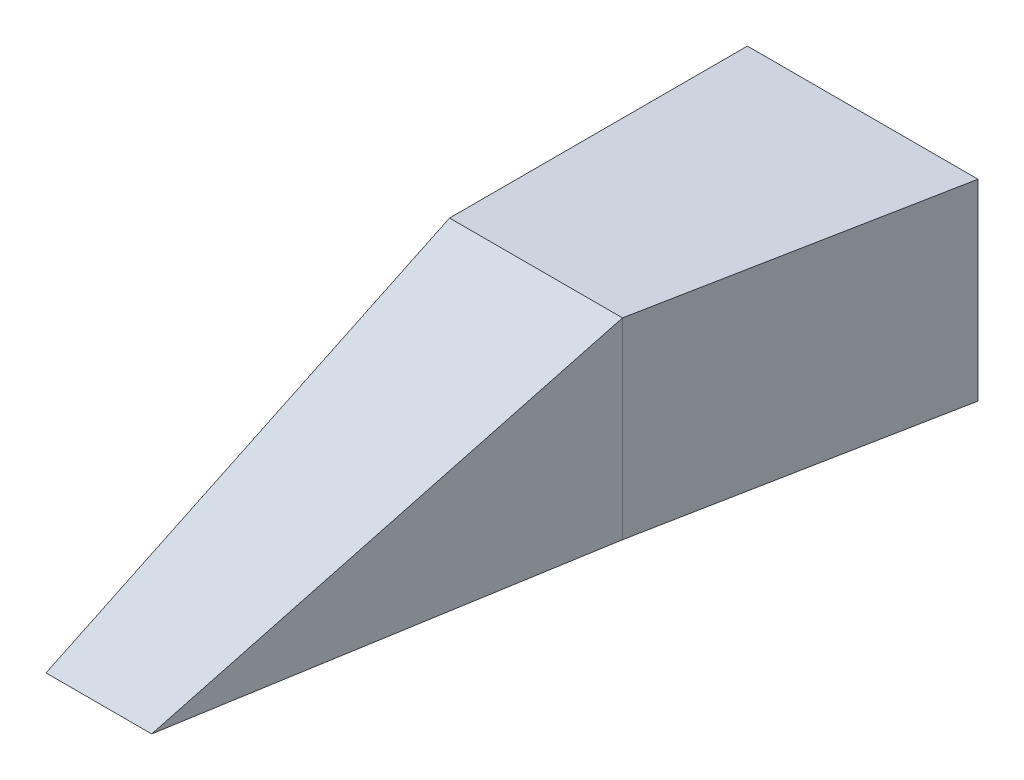
ISO-10303-21;
HEADER;
FILE_DESCRIPTION(('STEP AP214'),'2;1');
FILE_NAME('part.step','',(''),(''),'','','');
FILE_SCHEMA(('AUTOMOTIVE_DESIGN { 1 0 10303 214 1 1 1 1 }'));
ENDSEC;
DATA;
#1=APPLICATION_CONTEXT('core data for automotive mechanical design processes');
#2=APPLICATION_PROTOCOL_DEFINITION('international standard','automotive_design',2000,#1);
#3=PRODUCT_CONTEXT('',#1,'mechanical');
#4=PRODUCT('Part','Part','',(#3));
#5=PRODUCT_RELATED_PRODUCT_CATEGORY('part','',(#4));
#6=PRODUCT_DEFINITION_FORMATION('','',#4);
#7=PRODUCT_DEFINITION_CONTEXT('part definition',#1,'design');
#8=PRODUCT_DEFINITION('design','',#6,#7);
#9=PRODUCT_DEFINITION_SHAPE('','',#8);
#10=(LENGTH_UNIT() NAMED_UNIT(*) SI_UNIT(.MILLI.,.METRE.));
#11=(NAMED_UNIT(*) PLANE_ANGLE_UNIT() SI_UNIT($,.RADIAN.));
#12=(NAMED_UNIT(*) SI_UNIT($,.STERADIAN.) SOLID_ANGLE_UNIT());
#13=UNCERTAINTY_MEASURE_WITH_UNIT(LENGTH_MEASURE(1.E-05),#10,'distance_accuracy_value','');
#14=(GEOMETRIC_REPRESENTATION_CONTEXT(3) GLOBAL_UNCERTAINTY_ASSIGNED_CONTEXT((#13)) GLOBAL_UNIT_ASSIGNED_CONTEXT((#10,
#11,#12)) REPRESENTATION_CONTEXT('',''));
#15=CARTESIAN_POINT('',(0.,0.,0.));
#16=DIRECTION('',(0.,0.,1.));
#17=DIRECTION('',(1.,0.,0.));
#18=AXIS2_PLACEMENT_3D('',#15,#16,#17);
#19=CARTESIAN_POINT('',(0.,508.,-1066.8));
#20=DIRECTION('',(1.,0.,0.));
#21=DIRECTION('',(0.,0.,-1.));
#22=AXIS2_PLACEMENT_3D('',#19,#20,#21);
#23=PLANE('',#22);
#24=DIRECTION('',(0.,0.,1.));
#25=VECTOR('',#24,1.);
#26=CARTESIAN_POINT('',(0.,0.,-1066.8));
#27=LINE('',#26,#25);
#28=CARTESIAN_POINT('',(0.,0.,-1854.2));
#29=VERTEX_POINT('',#28);
#30=CARTESIAN_POINT('',(0.,0.,0.));
#31=VERTEX_POINT('',#30);
#32=EDGE_CURVE('E122',#29,#31,#27,.T.);
#33=ORIENTED_EDGE('',*,*,#32,.T.);
#34=DIRECTION('',(0.,-0.429933580392348,0.90286051882393));
#35=VECTOR('',#34,1.);
#36=CARTESIAN_POINT('',(0.,0.,0.));
#37=LINE('',#36,#35);
#38=CARTESIAN_POINT('',(0.,508.,-1066.8));
#39=VERTEX_POINT('',#38);
#40=EDGE_CURVE('E54',#39,#31,#37,.T.);
#41=ORIENTED_EDGE('',*,*,#40,.F.);
#42=DIRECTION('',(0.,0.,-1.));
#43=VECTOR('',#42,1.);
#44=CARTESIAN_POINT('',(0.,508.,-1066.8));
#45=LINE('',#44,#43);
#46=CARTESIAN_POINT('',(0.,508.,-1854.2));
#47=VERTEX_POINT('',#46);
#48=EDGE_CURVE('E100',#39,#47,#45,.T.);
#49=ORIENTED_EDGE('',*,*,#48,.T.);
#50=DIRECTION('',(0.,-1.,0.));
#51=VECTOR('',#50,1.);
#52=CARTESIAN_POINT('',(0.,508.,-1854.2));
#53=LINE('',#52,#51);
#54=EDGE_CURVE('E83',#47,#29,#53,.T.);
#55=ORIENTED_EDGE('',*,*,#54,.T.);
#56=EDGE_LOOP('',(#33,#41,#49,#55));
#57=FACE_BOUND('',#56,.T.);
#58=ADVANCED_FACE('F39',(#57),#23,.F.);
#59=CARTESIAN_POINT('',(279.4,508.,0.));
#60=DIRECTION('',(-0.986393923832144,0.,-0.164398987305357));
#61=DIRECTION('',(-0.164398987305357,0.,0.986393923832144));
#62=AXIS2_PLACEMENT_3D('',#59,#60,#61);
#63=PLANE('',#62);
#64=DIRECTION('',(0.,-1.,0.));
#65=VECTOR('',#64,1.);
#66=CARTESIAN_POINT('',(457.2,508.,-1066.8));
#67=LINE('',#66,#65);
#68=CARTESIAN_POINT('',(457.2,508.,-1066.8));
#69=VERTEX_POINT('',#68);
#70=CARTESIAN_POINT('',(457.2,0.,-1066.8));
#71=VERTEX_POINT('',#70);
#72=EDGE_CURVE('E11',#69,#71,#67,.T.);
#73=ORIENTED_EDGE('',*,*,#72,.F.);
#74=DIRECTION('',(-0.148801508186848,-0.425147166248136,0.892809049121087));
#75=VECTOR('',#74,1.);
#76=CARTESIAN_POINT('',(311.537370085856,91.8210573881609,-192.824220515138));
#77=LINE('',#76,#75);
#78=CARTESIAN_POINT('',(279.4,0.,0.));
#79=VERTEX_POINT('',#78);
#80=EDGE_CURVE('E119',#69,#79,#77,.T.);
#81=ORIENTED_EDGE('',*,*,#80,.T.);
#82=DIRECTION('',(0.164398987305357,0.,-0.986393923832144));
#83=VECTOR('',#82,1.);
#84=CARTESIAN_POINT('',(279.4,0.,0.));
#85=LINE('',#84,#83);
#86=EDGE_CURVE('E125',#79,#71,#85,.T.);
#87=ORIENTED_EDGE('',*,*,#86,.T.);
#88=EDGE_LOOP('',(#73,#81,#87));
#89=FACE_BOUND('',#88,.T.);
#90=ADVANCED_FACE('F133',(#89),#63,.F.);
#91=CARTESIAN_POINT('',(0.,0.,0.));
#92=DIRECTION('',(0.,1.,0.));
#93=DIRECTION('',(0.,0.,1.));
#94=AXIS2_PLACEMENT_3D('',#91,#92,#93);
#95=PLANE('',#94);
#96=ORIENTED_EDGE('',*,*,#32,.F.);
#97=DIRECTION('',(1.,0.,0.));
#98=VECTOR('',#97,1.);
#99=CARTESIAN_POINT('',(0.,0.,-1854.2));
#100=LINE('',#99,#98);
#101=CARTESIAN_POINT('',(609.6,0.,-1854.2));
#102=VERTEX_POINT('',#101);
#103=EDGE_CURVE('E89',#29,#102,#100,.T.);
#104=ORIENTED_EDGE('',*,*,#103,.T.);
#105=DIRECTION('',(-0.190021906565861,0.,0.981779850590281));
#106=VECTOR('',#105,1.);
#107=CARTESIAN_POINT('',(609.6,0.,-1854.2));
#108=LINE('',#107,#106);
#109=EDGE_CURVE('E105',#102,#71,#108,.T.);
#110=ORIENTED_EDGE('',*,*,#109,.T.);
#111=ORIENTED_EDGE('',*,*,#86,.F.);
#112=DIRECTION('',(1.,0.,0.));
#113=VECTOR('',#112,1.);
#114=CARTESIAN_POINT('',(0.,0.,0.));
#115=LINE('',#114,#113);
#116=EDGE_CURVE('E59',#31,#79,#115,.T.);
#117=ORIENTED_EDGE('',*,*,#116,.F.);
#118=EDGE_LOOP('',(#96,#104,#110,#111,#117));
#119=FACE_BOUND('',#118,.T.);
#120=ADVANCED_FACE('F138',(#119),#95,.F.);
#121=CARTESIAN_POINT('',(508.,0.,0.));
#122=DIRECTION('',(0.,-0.90286051882393,-0.429933580392348));
#123=DIRECTION('',(0.,0.429933580392348,-0.90286051882393));
#124=AXIS2_PLACEMENT_3D('',#121,#122,#123);
#125=PLANE('',#124);
#126=DIRECTION('',(-1.,0.,0.));
#127=VECTOR('',#126,1.);
#128=CARTESIAN_POINT('',(457.2,508.,-1066.8));
#129=LINE('',#128,#127);
#130=EDGE_CURVE('E47',#69,#39,#129,.T.);
#131=ORIENTED_EDGE('',*,*,#130,.T.);
#132=ORIENTED_EDGE('',*,*,#40,.T.);
#133=ORIENTED_EDGE('',*,*,#116,.T.);
#134=ORIENTED_EDGE('',*,*,#80,.F.);
#135=EDGE_LOOP('',(#131,#132,#133,#134));
#136=FACE_BOUND('',#135,.T.);
#137=ADVANCED_FACE('F140',(#136),#125,.F.);
#138=CARTESIAN_POINT('',(609.6,508.,-1854.2));
#139=DIRECTION('',(0.981779850590281,0.,0.190021906565861));
#140=DIRECTION('',(0.190021906565861,0.,-0.981779850590281));
#141=AXIS2_PLACEMENT_3D('',#138,#139,#140);
#142=PLANE('',#141);
#143=ORIENTED_EDGE('',*,*,#109,.F.);
#144=DIRECTION('',(0.,-1.,0.));
#145=VECTOR('',#144,1.);
#146=CARTESIAN_POINT('',(609.6,508.,-1854.2));
#147=LINE('',#146,#145);
#148=CARTESIAN_POINT('',(609.6,508.,-1854.2));
#149=VERTEX_POINT('',#148);
#150=EDGE_CURVE('E93',#149,#102,#147,.T.);
#151=ORIENTED_EDGE('',*,*,#150,.F.);
#152=DIRECTION('',(-0.190021906565861,0.,0.981779850590281));
#153=VECTOR('',#152,1.);
#154=CARTESIAN_POINT('',(609.6,508.,-1854.2));
#155=LINE('',#154,#153);
#156=EDGE_CURVE('E94',#149,#69,#155,.T.);
#157=ORIENTED_EDGE('',*,*,#156,.T.);
#158=ORIENTED_EDGE('',*,*,#72,.T.);
#159=EDGE_LOOP('',(#143,#151,#157,#158));
#160=FACE_BOUND('',#159,.T.);
#161=ADVANCED_FACE('F137',(#160),#142,.T.);
#162=CARTESIAN_POINT('',(0.,508.,-1854.2));
#163=DIRECTION('',(0.,0.,-1.));
#164=DIRECTION('',(-1.,0.,0.));
#165=AXIS2_PLACEMENT_3D('',#162,#163,#164);
#166=PLANE('',#165);
#167=ORIENTED_EDGE('',*,*,#103,.F.);
#168=ORIENTED_EDGE('',*,*,#54,.F.);
#169=DIRECTION('',(1.,0.,0.));
#170=VECTOR('',#169,1.);
#171=CARTESIAN_POINT('',(0.,508.,-1854.2));
#172=LINE('',#171,#170);
#173=EDGE_CURVE('E86',#47,#149,#172,.T.);
#174=ORIENTED_EDGE('',*,*,#173,.T.);
#175=ORIENTED_EDGE('',*,*,#150,.T.);
#176=EDGE_LOOP('',(#167,#168,#174,#175));
#177=FACE_BOUND('',#176,.T.);
#178=ADVANCED_FACE('F85',(#177),#166,.T.);
#179=CARTESIAN_POINT('',(0.,508.,0.));
#180=DIRECTION('',(0.,-1.,0.));
#181=DIRECTION('',(0.,0.,-1.));
#182=AXIS2_PLACEMENT_3D('',#179,#180,#181);
#183=PLANE('',#182);
#184=ORIENTED_EDGE('',*,*,#130,.F.);
#185=ORIENTED_EDGE('',*,*,#156,.F.);
#186=ORIENTED_EDGE('',*,*,#173,.F.);
#187=ORIENTED_EDGE('',*,*,#48,.F.);
#188=EDGE_LOOP('',(#184,#185,#186,#187));
#189=FACE_BOUND('',#188,.T.);
#190=ADVANCED_FACE('F99',(#189),#183,.F.);
#191=CLOSED_SHELL('',(#58,#90,#120,#137,#161,#178,#190));
#192=MANIFOLD_SOLID_BREP('B2',#191);
#193=ADVANCED_BREP_SHAPE_REPRESENTATION('',(#18,#192),#14);
#194=SHAPE_DEFINITION_REPRESENTATION(#9,#193);
ENDSEC;
END-ISO-10303-21;
